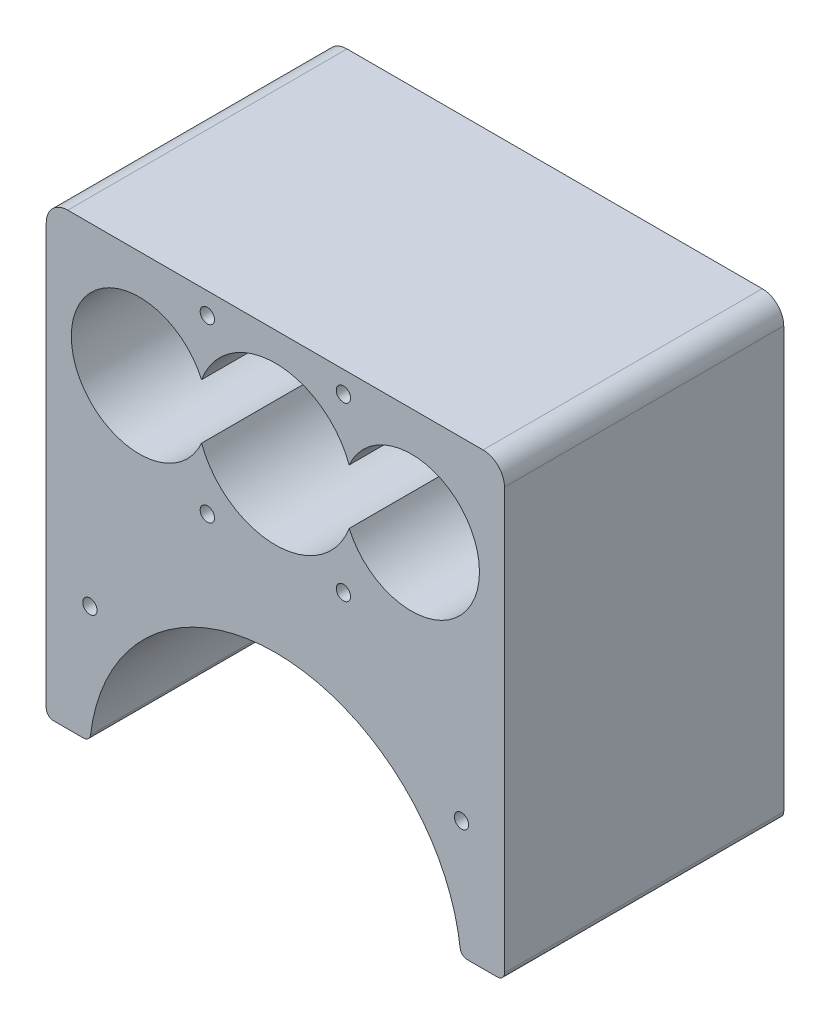
ISO-10303-21;
HEADER;
FILE_DESCRIPTION(('STEP AP214'),'2;1');
FILE_NAME('part.step','',(''),(''),'','','');
FILE_SCHEMA(('AUTOMOTIVE_DESIGN { 1 0 10303 214 1 1 1 1 }'));
ENDSEC;
DATA;
#1=APPLICATION_CONTEXT('core data for automotive mechanical design processes');
#2=APPLICATION_PROTOCOL_DEFINITION('international standard','automotive_design',2000,#1);
#3=PRODUCT_CONTEXT('',#1,'mechanical');
#4=PRODUCT('Part','Part','',(#3));
#5=PRODUCT_RELATED_PRODUCT_CATEGORY('part','',(#4));
#6=PRODUCT_DEFINITION_FORMATION('','',#4);
#7=PRODUCT_DEFINITION_CONTEXT('part definition',#1,'design');
#8=PRODUCT_DEFINITION('design','',#6,#7);
#9=PRODUCT_DEFINITION_SHAPE('','',#8);
#10=(LENGTH_UNIT() NAMED_UNIT(*) SI_UNIT(.MILLI.,.METRE.));
#11=(NAMED_UNIT(*) PLANE_ANGLE_UNIT() SI_UNIT($,.RADIAN.));
#12=(NAMED_UNIT(*) SI_UNIT($,.STERADIAN.) SOLID_ANGLE_UNIT());
#13=UNCERTAINTY_MEASURE_WITH_UNIT(LENGTH_MEASURE(1.E-05),#10,'distance_accuracy_value','');
#14=(GEOMETRIC_REPRESENTATION_CONTEXT(3) GLOBAL_UNCERTAINTY_ASSIGNED_CONTEXT((#13)) GLOBAL_UNIT_ASSIGNED_CONTEXT((#10,
#11,#12)) REPRESENTATION_CONTEXT('',''));
#15=CARTESIAN_POINT('',(0.,0.,0.));
#16=DIRECTION('',(0.,0.,1.));
#17=DIRECTION('',(1.,0.,0.));
#18=AXIS2_PLACEMENT_3D('',#15,#16,#17);
#19=CARTESIAN_POINT('',(-31.,-46.7536466451019,39.));
#20=DIRECTION('',(0.,0.,1.));
#21=DIRECTION('',(1.,0.,0.));
#22=AXIS2_PLACEMENT_3D('',#19,#20,#21);
#23=PLANE('',#22);
#24=CARTESIAN_POINT('',(-25.9027777777778,-31.358962600586,39.));
#25=DIRECTION('',(0.,0.,1.));
#26=DIRECTION('',(1.,0.,0.));
#27=AXIS2_PLACEMENT_3D('',#24,#25,#26);
#28=CIRCLE('',#27,1.);
#29=CARTESIAN_POINT('',(-24.9027777777778,-31.358962600586,39.));
#30=VERTEX_POINT('',#29);
#31=EDGE_CURVE('E557',#30,#30,#28,.T.);
#32=ORIENTED_EDGE('',*,*,#31,.F.);
#33=EDGE_LOOP('',(#32));
#34=FACE_BOUND('',#33,.T.);
#35=CARTESIAN_POINT('',(9.5,-12.,39.));
#36=DIRECTION('',(0.,0.,1.));
#37=DIRECTION('',(1.,0.,0.));
#38=AXIS2_PLACEMENT_3D('',#35,#36,#37);
#39=CIRCLE('',#38,1.);
#40=CARTESIAN_POINT('',(10.5,-12.,39.));
#41=VERTEX_POINT('',#40);
#42=EDGE_CURVE('E569',#41,#41,#39,.T.);
#43=ORIENTED_EDGE('',*,*,#42,.F.);
#44=EDGE_LOOP('',(#43));
#45=FACE_BOUND('',#44,.T.);
#46=CARTESIAN_POINT('',(-9.49999999999999,12.,39.));
#47=DIRECTION('',(0.,0.,1.));
#48=DIRECTION('',(1.,0.,0.));
#49=AXIS2_PLACEMENT_3D('',#46,#47,#48);
#50=CIRCLE('',#49,1.);
#51=CARTESIAN_POINT('',(-8.49999999999999,12.,39.));
#52=VERTEX_POINT('',#51);
#53=EDGE_CURVE('E175',#52,#52,#50,.T.);
#54=ORIENTED_EDGE('',*,*,#53,.F.);
#55=EDGE_LOOP('',(#54));
#56=FACE_BOUND('',#55,.T.);
#57=CARTESIAN_POINT('',(-31.,-46.7536466451019,39.));
#58=DIRECTION('',(0.,0.,1.));
#59=DIRECTION('',(1.,0.,0.));
#60=AXIS2_PLACEMENT_3D('',#57,#58,#59);
#61=CIRCLE('',#60,1.);
#62=CARTESIAN_POINT('',(-32.,-46.7536466451019,39.));
#63=VERTEX_POINT('',#62);
#64=CARTESIAN_POINT('',(-31.,-47.7536466451019,39.));
#65=VERTEX_POINT('',#64);
#66=EDGE_CURVE('E185',#63,#65,#61,.T.);
#67=ORIENTED_EDGE('',*,*,#66,.T.);
#68=DIRECTION('',(1.,0.,0.));
#69=VECTOR('',#68,1.);
#70=CARTESIAN_POINT('',(-31.,-47.7536466451019,39.));
#71=LINE('',#70,#69);
#72=CARTESIAN_POINT('',(-26.8041263594832,-47.7536466451019,39.));
#73=VERTEX_POINT('',#72);
#74=EDGE_CURVE('E188',#65,#73,#71,.T.);
#75=ORIENTED_EDGE('',*,*,#74,.T.);
#76=CARTESIAN_POINT('',(-26.8041263594832,-46.7536466451019,39.));
#77=DIRECTION('',(0.,0.,1.));
#78=DIRECTION('',(-1.,0.,0.));
#79=AXIS2_PLACEMENT_3D('',#76,#77,#78);
#80=CIRCLE('',#79,1.);
#81=CARTESIAN_POINT('',(-25.8113809387616,-46.8738819545426,39.));
#82=VERTEX_POINT('',#81);
#83=EDGE_CURVE('E191',#73,#82,#80,.T.);
#84=ORIENTED_EDGE('',*,*,#83,.T.);
#85=CARTESIAN_POINT('',(0.,-50.,39.));
#86=DIRECTION('',(0.,0.,-1.));
#87=DIRECTION('',(1.,0.,0.));
#88=AXIS2_PLACEMENT_3D('',#85,#86,#87);
#89=CIRCLE('',#88,26.);
#90=CARTESIAN_POINT('',(25.8113809387616,-46.8738819545426,39.));
#91=VERTEX_POINT('',#90);
#92=EDGE_CURVE('E193',#82,#91,#89,.T.);
#93=ORIENTED_EDGE('',*,*,#92,.T.);
#94=CARTESIAN_POINT('',(26.8041263594832,-46.7536466451019,39.));
#95=DIRECTION('',(0.,0.,1.));
#96=DIRECTION('',(-1.,0.,0.));
#97=AXIS2_PLACEMENT_3D('',#94,#95,#96);
#98=CIRCLE('',#97,1.);
#99=CARTESIAN_POINT('',(26.8041263594832,-47.7536466451019,39.));
#100=VERTEX_POINT('',#99);
#101=EDGE_CURVE('E195',#91,#100,#98,.T.);
#102=ORIENTED_EDGE('',*,*,#101,.T.);
#103=DIRECTION('',(1.,0.,0.));
#104=VECTOR('',#103,1.);
#105=CARTESIAN_POINT('',(31.,-47.7536466451019,39.));
#106=LINE('',#105,#104);
#107=CARTESIAN_POINT('',(31.,-47.7536466451019,39.));
#108=VERTEX_POINT('',#107);
#109=EDGE_CURVE('E197',#100,#108,#106,.T.);
#110=ORIENTED_EDGE('',*,*,#109,.T.);
#111=CARTESIAN_POINT('',(31.,-46.7536466451019,39.));
#112=DIRECTION('',(0.,0.,1.));
#113=DIRECTION('',(-1.,0.,0.));
#114=AXIS2_PLACEMENT_3D('',#111,#112,#113);
#115=CIRCLE('',#114,1.);
#116=CARTESIAN_POINT('',(32.,-46.7536466451019,39.));
#117=VERTEX_POINT('',#116);
#118=EDGE_CURVE('E199',#108,#117,#115,.T.);
#119=ORIENTED_EDGE('',*,*,#118,.T.);
#120=DIRECTION('',(0.,1.,0.));
#121=VECTOR('',#120,1.);
#122=CARTESIAN_POINT('',(32.,-17.,39.));
#123=LINE('',#122,#121);
#124=CARTESIAN_POINT('',(32.,12.,39.));
#125=VERTEX_POINT('',#124);
#126=EDGE_CURVE('E201',#117,#125,#123,.T.);
#127=ORIENTED_EDGE('',*,*,#126,.T.);
#128=CARTESIAN_POINT('',(29.,12.,39.));
#129=DIRECTION('',(0.,0.,1.));
#130=DIRECTION('',(-1.,0.,0.));
#131=AXIS2_PLACEMENT_3D('',#128,#129,#130);
#132=CIRCLE('',#131,3.);
#133=CARTESIAN_POINT('',(29.,15.,39.));
#134=VERTEX_POINT('',#133);
#135=EDGE_CURVE('E203',#125,#134,#132,.T.);
#136=ORIENTED_EDGE('',*,*,#135,.T.);
#137=DIRECTION('',(-1.,0.,0.));
#138=VECTOR('',#137,1.);
#139=CARTESIAN_POINT('',(-29.,15.,39.));
#140=LINE('',#139,#138);
#141=CARTESIAN_POINT('',(-29.,15.,39.));
#142=VERTEX_POINT('',#141);
#143=EDGE_CURVE('E205',#134,#142,#140,.T.);
#144=ORIENTED_EDGE('',*,*,#143,.T.);
#145=CARTESIAN_POINT('',(-29.,12.,39.));
#146=DIRECTION('',(0.,0.,1.));
#147=DIRECTION('',(-1.,0.,0.));
#148=AXIS2_PLACEMENT_3D('',#145,#146,#147);
#149=CIRCLE('',#148,3.);
#150=CARTESIAN_POINT('',(-32.,12.,39.));
#151=VERTEX_POINT('',#150);
#152=EDGE_CURVE('E207',#142,#151,#149,.T.);
#153=ORIENTED_EDGE('',*,*,#152,.T.);
#154=DIRECTION('',(0.,-1.,0.));
#155=VECTOR('',#154,1.);
#156=CARTESIAN_POINT('',(-32.,-17.,39.));
#157=LINE('',#156,#155);
#158=EDGE_CURVE('E209',#151,#63,#157,.T.);
#159=ORIENTED_EDGE('',*,*,#158,.T.);
#160=EDGE_LOOP('',(#67,#75,#84,#93,#102,#110,#119,#127,#136,#144,#153,#159));
#161=FACE_BOUND('',#160,.T.);
#162=CARTESIAN_POINT('',(-19.,0.,39.));
#163=DIRECTION('',(0.,0.,1.));
#164=DIRECTION('',(1.,0.,0.));
#165=AXIS2_PLACEMENT_3D('',#162,#163,#164);
#166=CIRCLE('',#165,9.5);
#167=CARTESIAN_POINT('',(-10.3092105263158,3.83668845804552,39.));
#168=VERTEX_POINT('',#167);
#169=CARTESIAN_POINT('',(-10.3092105263158,-3.83668845804552,39.));
#170=VERTEX_POINT('',#169);
#171=EDGE_CURVE('E154',#168,#170,#166,.T.);
#172=ORIENTED_EDGE('',*,*,#171,.F.);
#173=CARTESIAN_POINT('',(0.,0.,39.));
#174=DIRECTION('',(0.,0.,1.));
#175=DIRECTION('',(1.,0.,0.));
#176=AXIS2_PLACEMENT_3D('',#173,#174,#175);
#177=CIRCLE('',#176,11.);
#178=CARTESIAN_POINT('',(10.3092105263158,3.83668845804553,39.));
#179=VERTEX_POINT('',#178);
#180=EDGE_CURVE('E146',#179,#168,#177,.T.);
#181=ORIENTED_EDGE('',*,*,#180,.F.);
#182=CARTESIAN_POINT('',(19.,0.,39.));
#183=DIRECTION('',(0.,0.,1.));
#184=DIRECTION('',(1.,0.,0.));
#185=AXIS2_PLACEMENT_3D('',#182,#183,#184);
#186=CIRCLE('',#185,9.5);
#187=CARTESIAN_POINT('',(10.3092105263158,-3.83668845804552,39.));
#188=VERTEX_POINT('',#187);
#189=EDGE_CURVE('E169',#188,#179,#186,.T.);
#190=ORIENTED_EDGE('',*,*,#189,.F.);
#191=CARTESIAN_POINT('',(0.,0.,39.));
#192=DIRECTION('',(0.,0.,1.));
#193=DIRECTION('',(1.,0.,0.));
#194=AXIS2_PLACEMENT_3D('',#191,#192,#193);
#195=CIRCLE('',#194,11.);
#196=EDGE_CURVE('E167',#170,#188,#195,.T.);
#197=ORIENTED_EDGE('',*,*,#196,.F.);
#198=EDGE_LOOP('',(#172,#181,#190,#197));
#199=FACE_BOUND('',#198,.T.);
#200=CARTESIAN_POINT('',(9.5,12.,39.));
#201=DIRECTION('',(0.,0.,1.));
#202=DIRECTION('',(1.,0.,0.));
#203=AXIS2_PLACEMENT_3D('',#200,#201,#202);
#204=CIRCLE('',#203,1.);
#205=CARTESIAN_POINT('',(10.5,12.,39.));
#206=VERTEX_POINT('',#205);
#207=EDGE_CURVE('E575',#206,#206,#204,.T.);
#208=ORIENTED_EDGE('',*,*,#207,.F.);
#209=EDGE_LOOP('',(#208));
#210=FACE_BOUND('',#209,.T.);
#211=CARTESIAN_POINT('',(-9.49999999999999,-12.,39.));
#212=DIRECTION('',(0.,0.,1.));
#213=DIRECTION('',(1.,0.,0.));
#214=AXIS2_PLACEMENT_3D('',#211,#212,#213);
#215=CIRCLE('',#214,1.);
#216=CARTESIAN_POINT('',(-8.49999999999999,-12.,39.));
#217=VERTEX_POINT('',#216);
#218=EDGE_CURVE('E563',#217,#217,#215,.T.);
#219=ORIENTED_EDGE('',*,*,#218,.F.);
#220=EDGE_LOOP('',(#219));
#221=FACE_BOUND('',#220,.T.);
#222=CARTESIAN_POINT('',(26.,-31.358962600586,39.));
#223=DIRECTION('',(0.,0.,1.));
#224=DIRECTION('',(1.,0.,0.));
#225=AXIS2_PLACEMENT_3D('',#222,#223,#224);
#226=CIRCLE('',#225,1.);
#227=CARTESIAN_POINT('',(27.,-31.358962600586,39.));
#228=VERTEX_POINT('',#227);
#229=EDGE_CURVE('E548',#228,#228,#226,.T.);
#230=ORIENTED_EDGE('',*,*,#229,.F.);
#231=EDGE_LOOP('',(#230));
#232=FACE_BOUND('',#231,.T.);
#233=ADVANCED_FACE('F33',(#34,#45,#56,#161,#199,#210,#221,#232),#23,.T.);
#234=CARTESIAN_POINT('',(-31.,-46.7536466451019,0.));
#235=DIRECTION('',(0.,0.,1.));
#236=DIRECTION('',(1.,0.,0.));
#237=AXIS2_PLACEMENT_3D('',#234,#235,#236);
#238=PLANE('',#237);
#239=CARTESIAN_POINT('',(-31.,-46.7536466451019,0.));
#240=DIRECTION('',(0.,0.,1.));
#241=DIRECTION('',(1.,0.,0.));
#242=AXIS2_PLACEMENT_3D('',#239,#240,#241);
#243=CIRCLE('',#242,1.);
#244=CARTESIAN_POINT('',(-32.,-46.7536466451019,0.));
#245=VERTEX_POINT('',#244);
#246=CARTESIAN_POINT('',(-31.,-47.7536466451019,0.));
#247=VERTEX_POINT('',#246);
#248=EDGE_CURVE('E162',#245,#247,#243,.T.);
#249=ORIENTED_EDGE('',*,*,#248,.F.);
#250=DIRECTION('',(0.,-1.,0.));
#251=VECTOR('',#250,1.);
#252=CARTESIAN_POINT('',(-32.,-17.,0.));
#253=LINE('',#252,#251);
#254=CARTESIAN_POINT('',(-32.,12.,0.));
#255=VERTEX_POINT('',#254);
#256=EDGE_CURVE('E189',#255,#245,#253,.T.);
#257=ORIENTED_EDGE('',*,*,#256,.F.);
#258=CARTESIAN_POINT('',(-29.,12.,0.));
#259=DIRECTION('',(0.,0.,1.));
#260=DIRECTION('',(-1.,0.,0.));
#261=AXIS2_PLACEMENT_3D('',#258,#259,#260);
#262=CIRCLE('',#261,3.);
#263=CARTESIAN_POINT('',(-29.,15.,0.));
#264=VERTEX_POINT('',#263);
#265=EDGE_CURVE('E233',#264,#255,#262,.T.);
#266=ORIENTED_EDGE('',*,*,#265,.F.);
#267=DIRECTION('',(-1.,0.,0.));
#268=VECTOR('',#267,1.);
#269=CARTESIAN_POINT('',(-29.,15.,0.));
#270=LINE('',#269,#268);
#271=CARTESIAN_POINT('',(29.,15.,0.));
#272=VERTEX_POINT('',#271);
#273=EDGE_CURVE('E231',#272,#264,#270,.T.);
#274=ORIENTED_EDGE('',*,*,#273,.F.);
#275=CARTESIAN_POINT('',(29.,12.,0.));
#276=DIRECTION('',(0.,0.,1.));
#277=DIRECTION('',(-1.,0.,0.));
#278=AXIS2_PLACEMENT_3D('',#275,#276,#277);
#279=CIRCLE('',#278,3.);
#280=CARTESIAN_POINT('',(32.,12.,0.));
#281=VERTEX_POINT('',#280);
#282=EDGE_CURVE('E229',#281,#272,#279,.T.);
#283=ORIENTED_EDGE('',*,*,#282,.F.);
#284=DIRECTION('',(0.,1.,0.));
#285=VECTOR('',#284,1.);
#286=CARTESIAN_POINT('',(32.,-17.,0.));
#287=LINE('',#286,#285);
#288=CARTESIAN_POINT('',(32.,-46.7536466451019,0.));
#289=VERTEX_POINT('',#288);
#290=EDGE_CURVE('E227',#289,#281,#287,.T.);
#291=ORIENTED_EDGE('',*,*,#290,.F.);
#292=CARTESIAN_POINT('',(31.,-46.7536466451019,0.));
#293=DIRECTION('',(0.,0.,1.));
#294=DIRECTION('',(-1.,0.,0.));
#295=AXIS2_PLACEMENT_3D('',#292,#293,#294);
#296=CIRCLE('',#295,1.);
#297=CARTESIAN_POINT('',(31.,-47.7536466451019,0.));
#298=VERTEX_POINT('',#297);
#299=EDGE_CURVE('E224',#298,#289,#296,.T.);
#300=ORIENTED_EDGE('',*,*,#299,.F.);
#301=DIRECTION('',(1.,0.,0.));
#302=VECTOR('',#301,1.);
#303=CARTESIAN_POINT('',(31.,-47.7536466451019,0.));
#304=LINE('',#303,#302);
#305=CARTESIAN_POINT('',(26.8041263594832,-47.7536466451019,0.));
#306=VERTEX_POINT('',#305);
#307=EDGE_CURVE('E222',#306,#298,#304,.T.);
#308=ORIENTED_EDGE('',*,*,#307,.F.);
#309=CARTESIAN_POINT('',(26.8041263594832,-46.7536466451019,0.));
#310=DIRECTION('',(0.,0.,1.));
#311=DIRECTION('',(-1.,0.,0.));
#312=AXIS2_PLACEMENT_3D('',#309,#310,#311);
#313=CIRCLE('',#312,1.);
#314=CARTESIAN_POINT('',(25.8113809387616,-46.8738819545426,0.));
#315=VERTEX_POINT('',#314);
#316=EDGE_CURVE('E220',#315,#306,#313,.T.);
#317=ORIENTED_EDGE('',*,*,#316,.F.);
#318=CARTESIAN_POINT('',(0.,-50.,0.));
#319=DIRECTION('',(0.,0.,-1.));
#320=DIRECTION('',(1.,0.,0.));
#321=AXIS2_PLACEMENT_3D('',#318,#319,#320);
#322=CIRCLE('',#321,26.);
#323=CARTESIAN_POINT('',(-25.8113809387616,-46.8738819545426,0.));
#324=VERTEX_POINT('',#323);
#325=EDGE_CURVE('E218',#324,#315,#322,.T.);
#326=ORIENTED_EDGE('',*,*,#325,.F.);
#327=CARTESIAN_POINT('',(-26.8041263594832,-46.7536466451019,0.));
#328=DIRECTION('',(0.,0.,1.));
#329=DIRECTION('',(-1.,0.,0.));
#330=AXIS2_PLACEMENT_3D('',#327,#328,#329);
#331=CIRCLE('',#330,1.);
#332=CARTESIAN_POINT('',(-26.8041263594832,-47.7536466451019,0.));
#333=VERTEX_POINT('',#332);
#334=EDGE_CURVE('E216',#333,#324,#331,.T.);
#335=ORIENTED_EDGE('',*,*,#334,.F.);
#336=DIRECTION('',(1.,0.,0.));
#337=VECTOR('',#336,1.);
#338=CARTESIAN_POINT('',(-31.,-47.7536466451019,0.));
#339=LINE('',#338,#337);
#340=EDGE_CURVE('E214',#247,#333,#339,.T.);
#341=ORIENTED_EDGE('',*,*,#340,.F.);
#342=EDGE_LOOP('',(#249,#257,#266,#274,#283,#291,#300,#308,#317,#326,#335,#341));
#343=FACE_BOUND('',#342,.T.);
#344=CARTESIAN_POINT('',(0.,0.,0.));
#345=DIRECTION('',(0.,0.,1.));
#346=DIRECTION('',(1.,0.,0.));
#347=AXIS2_PLACEMENT_3D('',#344,#345,#346);
#348=CIRCLE('',#347,11.);
#349=CARTESIAN_POINT('',(10.3092105263158,3.83668845804553,0.));
#350=VERTEX_POINT('',#349);
#351=CARTESIAN_POINT('',(-10.3092105263158,3.83668845804552,0.));
#352=VERTEX_POINT('',#351);
#353=EDGE_CURVE('E56',#350,#352,#348,.T.);
#354=ORIENTED_EDGE('',*,*,#353,.T.);
#355=CARTESIAN_POINT('',(-19.,0.,0.));
#356=DIRECTION('',(0.,0.,1.));
#357=DIRECTION('',(1.,0.,0.));
#358=AXIS2_PLACEMENT_3D('',#355,#356,#357);
#359=CIRCLE('',#358,9.5);
#360=CARTESIAN_POINT('',(-10.3092105263158,-3.83668845804552,0.));
#361=VERTEX_POINT('',#360);
#362=EDGE_CURVE('E161',#352,#361,#359,.T.);
#363=ORIENTED_EDGE('',*,*,#362,.T.);
#364=CARTESIAN_POINT('',(0.,0.,0.));
#365=DIRECTION('',(0.,0.,1.));
#366=DIRECTION('',(1.,0.,0.));
#367=AXIS2_PLACEMENT_3D('',#364,#365,#366);
#368=CIRCLE('',#367,11.);
#369=CARTESIAN_POINT('',(10.3092105263158,-3.83668845804552,0.));
#370=VERTEX_POINT('',#369);
#371=EDGE_CURVE('E177',#361,#370,#368,.T.);
#372=ORIENTED_EDGE('',*,*,#371,.T.);
#373=CARTESIAN_POINT('',(19.,0.,0.));
#374=DIRECTION('',(0.,0.,1.));
#375=DIRECTION('',(1.,0.,0.));
#376=AXIS2_PLACEMENT_3D('',#373,#374,#375);
#377=CIRCLE('',#376,9.5);
#378=EDGE_CURVE('E155',#370,#350,#377,.T.);
#379=ORIENTED_EDGE('',*,*,#378,.T.);
#380=EDGE_LOOP('',(#354,#363,#372,#379));
#381=FACE_BOUND('',#380,.T.);
#382=CARTESIAN_POINT('',(-9.49999999999999,12.,0.));
#383=DIRECTION('',(0.,0.,1.));
#384=DIRECTION('',(1.,0.,0.));
#385=AXIS2_PLACEMENT_3D('',#382,#383,#384);
#386=CIRCLE('',#385,1.);
#387=CARTESIAN_POINT('',(-8.49999999999999,12.,0.));
#388=VERTEX_POINT('',#387);
#389=EDGE_CURVE('E578',#388,#388,#386,.T.);
#390=ORIENTED_EDGE('',*,*,#389,.T.);
#391=EDGE_LOOP('',(#390));
#392=FACE_BOUND('',#391,.T.);
#393=CARTESIAN_POINT('',(9.5,12.,0.));
#394=DIRECTION('',(0.,0.,1.));
#395=DIRECTION('',(1.,0.,0.));
#396=AXIS2_PLACEMENT_3D('',#393,#394,#395);
#397=CIRCLE('',#396,1.);
#398=CARTESIAN_POINT('',(10.5,12.,0.));
#399=VERTEX_POINT('',#398);
#400=EDGE_CURVE('E572',#399,#399,#397,.T.);
#401=ORIENTED_EDGE('',*,*,#400,.T.);
#402=EDGE_LOOP('',(#401));
#403=FACE_BOUND('',#402,.T.);
#404=CARTESIAN_POINT('',(9.5,-12.,0.));
#405=DIRECTION('',(0.,0.,1.));
#406=DIRECTION('',(1.,0.,0.));
#407=AXIS2_PLACEMENT_3D('',#404,#405,#406);
#408=CIRCLE('',#407,1.);
#409=CARTESIAN_POINT('',(10.5,-12.,0.));
#410=VERTEX_POINT('',#409);
#411=EDGE_CURVE('E566',#410,#410,#408,.T.);
#412=ORIENTED_EDGE('',*,*,#411,.T.);
#413=EDGE_LOOP('',(#412));
#414=FACE_BOUND('',#413,.T.);
#415=CARTESIAN_POINT('',(-9.49999999999999,-12.,0.));
#416=DIRECTION('',(0.,0.,1.));
#417=DIRECTION('',(1.,0.,0.));
#418=AXIS2_PLACEMENT_3D('',#415,#416,#417);
#419=CIRCLE('',#418,1.);
#420=CARTESIAN_POINT('',(-8.49999999999999,-12.,0.));
#421=VERTEX_POINT('',#420);
#422=EDGE_CURVE('E560',#421,#421,#419,.T.);
#423=ORIENTED_EDGE('',*,*,#422,.T.);
#424=EDGE_LOOP('',(#423));
#425=FACE_BOUND('',#424,.T.);
#426=CARTESIAN_POINT('',(-25.9027777777778,-31.358962600586,0.));
#427=DIRECTION('',(0.,0.,1.));
#428=DIRECTION('',(1.,0.,0.));
#429=AXIS2_PLACEMENT_3D('',#426,#427,#428);
#430=CIRCLE('',#429,1.);
#431=CARTESIAN_POINT('',(-24.9027777777778,-31.358962600586,0.));
#432=VERTEX_POINT('',#431);
#433=EDGE_CURVE('E554',#432,#432,#430,.T.);
#434=ORIENTED_EDGE('',*,*,#433,.T.);
#435=EDGE_LOOP('',(#434));
#436=FACE_BOUND('',#435,.T.);
#437=CARTESIAN_POINT('',(26.,-31.358962600586,0.));
#438=DIRECTION('',(0.,0.,1.));
#439=DIRECTION('',(1.,0.,0.));
#440=AXIS2_PLACEMENT_3D('',#437,#438,#439);
#441=CIRCLE('',#440,1.);
#442=CARTESIAN_POINT('',(27.,-31.358962600586,0.));
#443=VERTEX_POINT('',#442);
#444=EDGE_CURVE('E551',#443,#443,#441,.T.);
#445=ORIENTED_EDGE('',*,*,#444,.T.);
#446=EDGE_LOOP('',(#445));
#447=FACE_BOUND('',#446,.T.);
#448=ADVANCED_FACE('F276',(#343,#381,#392,#403,#414,#425,#436,#447),#238,.F.);
#449=CARTESIAN_POINT('',(-31.,-46.7536466451019,39.));
#450=DIRECTION('',(0.,0.,-1.));
#451=DIRECTION('',(-1.,0.,0.));
#452=AXIS2_PLACEMENT_3D('',#449,#450,#451);
#453=CYLINDRICAL_SURFACE('',#452,1.);
#454=ORIENTED_EDGE('',*,*,#248,.T.);
#455=DIRECTION('',(0.,0.,-1.));
#456=VECTOR('',#455,1.);
#457=CARTESIAN_POINT('',(-31.,-47.7536466451019,39.));
#458=LINE('',#457,#456);
#459=EDGE_CURVE('E11',#65,#247,#458,.T.);
#460=ORIENTED_EDGE('',*,*,#459,.F.);
#461=ORIENTED_EDGE('',*,*,#66,.F.);
#462=DIRECTION('',(0.,0.,-1.));
#463=VECTOR('',#462,1.);
#464=CARTESIAN_POINT('',(-32.,-46.7536466451019,39.));
#465=LINE('',#464,#463);
#466=EDGE_CURVE('E211',#63,#245,#465,.T.);
#467=ORIENTED_EDGE('',*,*,#466,.T.);
#468=EDGE_LOOP('',(#454,#460,#461,#467));
#469=FACE_BOUND('',#468,.T.);
#470=ADVANCED_FACE('F35',(#469),#453,.T.);
#471=CARTESIAN_POINT('',(-31.,-47.7536466451019,39.));
#472=DIRECTION('',(0.,1.,0.));
#473=DIRECTION('',(0.,0.,1.));
#474=AXIS2_PLACEMENT_3D('',#471,#472,#473);
#475=PLANE('',#474);
#476=ORIENTED_EDGE('',*,*,#340,.T.);
#477=DIRECTION('',(0.,0.,-1.));
#478=VECTOR('',#477,1.);
#479=CARTESIAN_POINT('',(-26.8041263594832,-47.7536466451019,39.));
#480=LINE('',#479,#478);
#481=EDGE_CURVE('E41',#73,#333,#480,.T.);
#482=ORIENTED_EDGE('',*,*,#481,.F.);
#483=ORIENTED_EDGE('',*,*,#74,.F.);
#484=ORIENTED_EDGE('',*,*,#459,.T.);
#485=EDGE_LOOP('',(#476,#482,#483,#484));
#486=FACE_BOUND('',#485,.T.);
#487=ADVANCED_FACE('F293',(#486),#475,.F.);
#488=CARTESIAN_POINT('',(-26.8041263594832,-46.7536466451019,39.));
#489=DIRECTION('',(0.,0.,-1.));
#490=DIRECTION('',(-1.,0.,0.));
#491=AXIS2_PLACEMENT_3D('',#488,#489,#490);
#492=CYLINDRICAL_SURFACE('',#491,1.);
#493=ORIENTED_EDGE('',*,*,#334,.T.);
#494=DIRECTION('',(0.,0.,-1.));
#495=VECTOR('',#494,1.);
#496=CARTESIAN_POINT('',(-25.8113809387616,-46.8738819545426,39.));
#497=LINE('',#496,#495);
#498=EDGE_CURVE('E263',#82,#324,#497,.T.);
#499=ORIENTED_EDGE('',*,*,#498,.F.);
#500=ORIENTED_EDGE('',*,*,#83,.F.);
#501=ORIENTED_EDGE('',*,*,#481,.T.);
#502=EDGE_LOOP('',(#493,#499,#500,#501));
#503=FACE_BOUND('',#502,.T.);
#504=ADVANCED_FACE('F270',(#503),#492,.T.);
#505=CARTESIAN_POINT('',(0.,-50.,39.));
#506=DIRECTION('',(0.,0.,-1.));
#507=DIRECTION('',(-1.,0.,0.));
#508=AXIS2_PLACEMENT_3D('',#505,#506,#507);
#509=CYLINDRICAL_SURFACE('',#508,26.);
#510=ORIENTED_EDGE('',*,*,#325,.T.);
#511=DIRECTION('',(0.,0.,-1.));
#512=VECTOR('',#511,1.);
#513=CARTESIAN_POINT('',(25.8113809387616,-46.8738819545426,39.));
#514=LINE('',#513,#512);
#515=EDGE_CURVE('E260',#91,#315,#514,.T.);
#516=ORIENTED_EDGE('',*,*,#515,.F.);
#517=ORIENTED_EDGE('',*,*,#92,.F.);
#518=ORIENTED_EDGE('',*,*,#498,.T.);
#519=EDGE_LOOP('',(#510,#516,#517,#518));
#520=FACE_BOUND('',#519,.T.);
#521=ADVANCED_FACE('F282',(#520),#509,.F.);
#522=CARTESIAN_POINT('',(26.8041263594832,-46.7536466451019,39.));
#523=DIRECTION('',(0.,0.,-1.));
#524=DIRECTION('',(-1.,0.,0.));
#525=AXIS2_PLACEMENT_3D('',#522,#523,#524);
#526=CYLINDRICAL_SURFACE('',#525,1.);
#527=ORIENTED_EDGE('',*,*,#316,.T.);
#528=DIRECTION('',(0.,0.,-1.));
#529=VECTOR('',#528,1.);
#530=CARTESIAN_POINT('',(26.8041263594832,-47.7536466451019,39.));
#531=LINE('',#530,#529);
#532=EDGE_CURVE('E257',#100,#306,#531,.T.);
#533=ORIENTED_EDGE('',*,*,#532,.F.);
#534=ORIENTED_EDGE('',*,*,#101,.F.);
#535=ORIENTED_EDGE('',*,*,#515,.T.);
#536=EDGE_LOOP('',(#527,#533,#534,#535));
#537=FACE_BOUND('',#536,.T.);
#538=ADVANCED_FACE('F286',(#537),#526,.T.);
#539=CARTESIAN_POINT('',(31.,-47.7536466451019,39.));
#540=DIRECTION('',(0.,1.,0.));
#541=DIRECTION('',(0.,0.,1.));
#542=AXIS2_PLACEMENT_3D('',#539,#540,#541);
#543=PLANE('',#542);
#544=ORIENTED_EDGE('',*,*,#307,.T.);
#545=DIRECTION('',(0.,0.,-1.));
#546=VECTOR('',#545,1.);
#547=CARTESIAN_POINT('',(31.,-47.7536466451019,39.));
#548=LINE('',#547,#546);
#549=EDGE_CURVE('E254',#108,#298,#548,.T.);
#550=ORIENTED_EDGE('',*,*,#549,.F.);
#551=ORIENTED_EDGE('',*,*,#109,.F.);
#552=ORIENTED_EDGE('',*,*,#532,.T.);
#553=EDGE_LOOP('',(#544,#550,#551,#552));
#554=FACE_BOUND('',#553,.T.);
#555=ADVANCED_FACE('F324',(#554),#543,.F.);
#556=CARTESIAN_POINT('',(31.,-46.7536466451019,39.));
#557=DIRECTION('',(0.,0.,-1.));
#558=DIRECTION('',(-1.,0.,0.));
#559=AXIS2_PLACEMENT_3D('',#556,#557,#558);
#560=CYLINDRICAL_SURFACE('',#559,1.);
#561=ORIENTED_EDGE('',*,*,#299,.T.);
#562=DIRECTION('',(0.,0.,-1.));
#563=VECTOR('',#562,1.);
#564=CARTESIAN_POINT('',(32.,-46.7536466451019,39.));
#565=LINE('',#564,#563);
#566=EDGE_CURVE('E251',#117,#289,#565,.T.);
#567=ORIENTED_EDGE('',*,*,#566,.F.);
#568=ORIENTED_EDGE('',*,*,#118,.F.);
#569=ORIENTED_EDGE('',*,*,#549,.T.);
#570=EDGE_LOOP('',(#561,#567,#568,#569));
#571=FACE_BOUND('',#570,.T.);
#572=ADVANCED_FACE('F322',(#571),#560,.T.);
#573=CARTESIAN_POINT('',(32.,-17.,39.));
#574=DIRECTION('',(-1.,0.,0.));
#575=DIRECTION('',(0.,0.,1.));
#576=AXIS2_PLACEMENT_3D('',#573,#574,#575);
#577=PLANE('',#576);
#578=ORIENTED_EDGE('',*,*,#290,.T.);
#579=DIRECTION('',(0.,0.,-1.));
#580=VECTOR('',#579,1.);
#581=CARTESIAN_POINT('',(32.,12.,39.));
#582=LINE('',#581,#580);
#583=EDGE_CURVE('E248',#125,#281,#582,.T.);
#584=ORIENTED_EDGE('',*,*,#583,.F.);
#585=ORIENTED_EDGE('',*,*,#126,.F.);
#586=ORIENTED_EDGE('',*,*,#566,.T.);
#587=EDGE_LOOP('',(#578,#584,#585,#586));
#588=FACE_BOUND('',#587,.T.);
#589=ADVANCED_FACE('F318',(#588),#577,.F.);
#590=CARTESIAN_POINT('',(29.,12.,39.));
#591=DIRECTION('',(0.,0.,-1.));
#592=DIRECTION('',(-1.,0.,0.));
#593=AXIS2_PLACEMENT_3D('',#590,#591,#592);
#594=CYLINDRICAL_SURFACE('',#593,3.);
#595=ORIENTED_EDGE('',*,*,#282,.T.);
#596=DIRECTION('',(0.,0.,-1.));
#597=VECTOR('',#596,1.);
#598=CARTESIAN_POINT('',(29.,15.,39.));
#599=LINE('',#598,#597);
#600=EDGE_CURVE('E245',#134,#272,#599,.T.);
#601=ORIENTED_EDGE('',*,*,#600,.F.);
#602=ORIENTED_EDGE('',*,*,#135,.F.);
#603=ORIENTED_EDGE('',*,*,#583,.T.);
#604=EDGE_LOOP('',(#595,#601,#602,#603));
#605=FACE_BOUND('',#604,.T.);
#606=ADVANCED_FACE('F314',(#605),#594,.T.);
#607=CARTESIAN_POINT('',(-29.,15.,39.));
#608=DIRECTION('',(0.,-1.,0.));
#609=DIRECTION('',(0.,0.,-1.));
#610=AXIS2_PLACEMENT_3D('',#607,#608,#609);
#611=PLANE('',#610);
#612=ORIENTED_EDGE('',*,*,#273,.T.);
#613=DIRECTION('',(0.,0.,-1.));
#614=VECTOR('',#613,1.);
#615=CARTESIAN_POINT('',(-29.,15.,39.));
#616=LINE('',#615,#614);
#617=EDGE_CURVE('E242',#142,#264,#616,.T.);
#618=ORIENTED_EDGE('',*,*,#617,.F.);
#619=ORIENTED_EDGE('',*,*,#143,.F.);
#620=ORIENTED_EDGE('',*,*,#600,.T.);
#621=EDGE_LOOP('',(#612,#618,#619,#620));
#622=FACE_BOUND('',#621,.T.);
#623=ADVANCED_FACE('F310',(#622),#611,.F.);
#624=CARTESIAN_POINT('',(-29.,12.,39.));
#625=DIRECTION('',(0.,0.,-1.));
#626=DIRECTION('',(-1.,0.,0.));
#627=AXIS2_PLACEMENT_3D('',#624,#625,#626);
#628=CYLINDRICAL_SURFACE('',#627,3.);
#629=ORIENTED_EDGE('',*,*,#265,.T.);
#630=DIRECTION('',(0.,0.,-1.));
#631=VECTOR('',#630,1.);
#632=CARTESIAN_POINT('',(-32.,12.,39.));
#633=LINE('',#632,#631);
#634=EDGE_CURVE('E239',#151,#255,#633,.T.);
#635=ORIENTED_EDGE('',*,*,#634,.F.);
#636=ORIENTED_EDGE('',*,*,#152,.F.);
#637=ORIENTED_EDGE('',*,*,#617,.T.);
#638=EDGE_LOOP('',(#629,#635,#636,#637));
#639=FACE_BOUND('',#638,.T.);
#640=ADVANCED_FACE('F301',(#639),#628,.T.);
#641=CARTESIAN_POINT('',(-32.,-17.,39.));
#642=DIRECTION('',(1.,0.,0.));
#643=DIRECTION('',(0.,0.,-1.));
#644=AXIS2_PLACEMENT_3D('',#641,#642,#643);
#645=PLANE('',#644);
#646=ORIENTED_EDGE('',*,*,#256,.T.);
#647=ORIENTED_EDGE('',*,*,#466,.F.);
#648=ORIENTED_EDGE('',*,*,#158,.F.);
#649=ORIENTED_EDGE('',*,*,#634,.T.);
#650=EDGE_LOOP('',(#646,#647,#648,#649));
#651=FACE_BOUND('',#650,.T.);
#652=ADVANCED_FACE('F305',(#651),#645,.F.);
#653=CARTESIAN_POINT('',(0.,0.,39.));
#654=DIRECTION('',(0.,0.,-1.));
#655=DIRECTION('',(-1.,0.,0.));
#656=AXIS2_PLACEMENT_3D('',#653,#654,#655);
#657=CYLINDRICAL_SURFACE('',#656,11.);
#658=ORIENTED_EDGE('',*,*,#353,.F.);
#659=DIRECTION('',(0.,0.,-1.));
#660=VECTOR('',#659,1.);
#661=CARTESIAN_POINT('',(10.3092105263158,3.83668845804553,39.));
#662=LINE('',#661,#660);
#663=EDGE_CURVE('E150',#179,#350,#662,.T.);
#664=ORIENTED_EDGE('',*,*,#663,.F.);
#665=ORIENTED_EDGE('',*,*,#180,.T.);
#666=DIRECTION('',(0.,0.,-1.));
#667=VECTOR('',#666,1.);
#668=CARTESIAN_POINT('',(-10.3092105263158,3.83668845804552,39.));
#669=LINE('',#668,#667);
#670=EDGE_CURVE('E149',#168,#352,#669,.T.);
#671=ORIENTED_EDGE('',*,*,#670,.T.);
#672=EDGE_LOOP('',(#658,#664,#665,#671));
#673=FACE_BOUND('',#672,.T.);
#674=ADVANCED_FACE('F148',(#673),#657,.F.);
#675=CARTESIAN_POINT('',(-19.,0.,39.));
#676=DIRECTION('',(0.,0.,-1.));
#677=DIRECTION('',(-1.,0.,0.));
#678=AXIS2_PLACEMENT_3D('',#675,#676,#677);
#679=CYLINDRICAL_SURFACE('',#678,9.5);
#680=ORIENTED_EDGE('',*,*,#362,.F.);
#681=ORIENTED_EDGE('',*,*,#670,.F.);
#682=ORIENTED_EDGE('',*,*,#171,.T.);
#683=DIRECTION('',(0.,0.,-1.));
#684=VECTOR('',#683,1.);
#685=CARTESIAN_POINT('',(-10.3092105263158,-3.83668845804552,39.));
#686=LINE('',#685,#684);
#687=EDGE_CURVE('E163',#170,#361,#686,.T.);
#688=ORIENTED_EDGE('',*,*,#687,.T.);
#689=EDGE_LOOP('',(#680,#681,#682,#688));
#690=FACE_BOUND('',#689,.T.);
#691=ADVANCED_FACE('F158',(#690),#679,.F.);
#692=CARTESIAN_POINT('',(0.,0.,39.));
#693=DIRECTION('',(0.,0.,-1.));
#694=DIRECTION('',(-1.,0.,0.));
#695=AXIS2_PLACEMENT_3D('',#692,#693,#694);
#696=CYLINDRICAL_SURFACE('',#695,11.);
#697=ORIENTED_EDGE('',*,*,#371,.F.);
#698=ORIENTED_EDGE('',*,*,#687,.F.);
#699=ORIENTED_EDGE('',*,*,#196,.T.);
#700=DIRECTION('',(0.,0.,-1.));
#701=VECTOR('',#700,1.);
#702=CARTESIAN_POINT('',(10.3092105263158,-3.83668845804552,39.));
#703=LINE('',#702,#701);
#704=EDGE_CURVE('E48',#188,#370,#703,.T.);
#705=ORIENTED_EDGE('',*,*,#704,.T.);
#706=EDGE_LOOP('',(#697,#698,#699,#705));
#707=FACE_BOUND('',#706,.T.);
#708=ADVANCED_FACE('F385',(#707),#696,.F.);
#709=CARTESIAN_POINT('',(19.,0.,39.));
#710=DIRECTION('',(0.,0.,-1.));
#711=DIRECTION('',(-1.,0.,0.));
#712=AXIS2_PLACEMENT_3D('',#709,#710,#711);
#713=CYLINDRICAL_SURFACE('',#712,9.5);
#714=ORIENTED_EDGE('',*,*,#378,.F.);
#715=ORIENTED_EDGE('',*,*,#704,.F.);
#716=ORIENTED_EDGE('',*,*,#189,.T.);
#717=ORIENTED_EDGE('',*,*,#663,.T.);
#718=EDGE_LOOP('',(#714,#715,#716,#717));
#719=FACE_BOUND('',#718,.T.);
#720=ADVANCED_FACE('F391',(#719),#713,.F.);
#721=CARTESIAN_POINT('',(-9.49999999999999,12.,39.));
#722=DIRECTION('',(0.,0.,-1.));
#723=DIRECTION('',(-1.,0.,0.));
#724=AXIS2_PLACEMENT_3D('',#721,#722,#723);
#725=CYLINDRICAL_SURFACE('',#724,1.);
#726=ORIENTED_EDGE('',*,*,#53,.T.);
#727=EDGE_LOOP('',(#726));
#728=FACE_BOUND('',#727,.T.);
#729=ORIENTED_EDGE('',*,*,#389,.F.);
#730=EDGE_LOOP('',(#729));
#731=FACE_BOUND('',#730,.T.);
#732=ADVANCED_FACE('F399',(#728,#731),#725,.F.);
#733=CARTESIAN_POINT('',(9.5,12.,39.));
#734=DIRECTION('',(0.,0.,-1.));
#735=DIRECTION('',(-1.,0.,0.));
#736=AXIS2_PLACEMENT_3D('',#733,#734,#735);
#737=CYLINDRICAL_SURFACE('',#736,1.);
#738=ORIENTED_EDGE('',*,*,#207,.T.);
#739=EDGE_LOOP('',(#738));
#740=FACE_BOUND('',#739,.T.);
#741=ORIENTED_EDGE('',*,*,#400,.F.);
#742=EDGE_LOOP('',(#741));
#743=FACE_BOUND('',#742,.T.);
#744=ADVANCED_FACE('F406',(#740,#743),#737,.F.);
#745=CARTESIAN_POINT('',(9.5,-12.,39.));
#746=DIRECTION('',(0.,0.,-1.));
#747=DIRECTION('',(-1.,0.,0.));
#748=AXIS2_PLACEMENT_3D('',#745,#746,#747);
#749=CYLINDRICAL_SURFACE('',#748,1.);
#750=ORIENTED_EDGE('',*,*,#42,.T.);
#751=EDGE_LOOP('',(#750));
#752=FACE_BOUND('',#751,.T.);
#753=ORIENTED_EDGE('',*,*,#411,.F.);
#754=EDGE_LOOP('',(#753));
#755=FACE_BOUND('',#754,.T.);
#756=ADVANCED_FACE('F414',(#752,#755),#749,.F.);
#757=CARTESIAN_POINT('',(-9.49999999999999,-12.,39.));
#758=DIRECTION('',(0.,0.,-1.));
#759=DIRECTION('',(-1.,0.,0.));
#760=AXIS2_PLACEMENT_3D('',#757,#758,#759);
#761=CYLINDRICAL_SURFACE('',#760,1.);
#762=ORIENTED_EDGE('',*,*,#218,.T.);
#763=EDGE_LOOP('',(#762));
#764=FACE_BOUND('',#763,.T.);
#765=ORIENTED_EDGE('',*,*,#422,.F.);
#766=EDGE_LOOP('',(#765));
#767=FACE_BOUND('',#766,.T.);
#768=ADVANCED_FACE('F422',(#764,#767),#761,.F.);
#769=CARTESIAN_POINT('',(-25.9027777777778,-31.358962600586,39.));
#770=DIRECTION('',(0.,0.,-1.));
#771=DIRECTION('',(-1.,0.,0.));
#772=AXIS2_PLACEMENT_3D('',#769,#770,#771);
#773=CYLINDRICAL_SURFACE('',#772,1.);
#774=ORIENTED_EDGE('',*,*,#31,.T.);
#775=EDGE_LOOP('',(#774));
#776=FACE_BOUND('',#775,.T.);
#777=ORIENTED_EDGE('',*,*,#433,.F.);
#778=EDGE_LOOP('',(#777));
#779=FACE_BOUND('',#778,.T.);
#780=ADVANCED_FACE('F430',(#776,#779),#773,.F.);
#781=CARTESIAN_POINT('',(26.,-31.358962600586,39.));
#782=DIRECTION('',(0.,0.,-1.));
#783=DIRECTION('',(-1.,0.,0.));
#784=AXIS2_PLACEMENT_3D('',#781,#782,#783);
#785=CYLINDRICAL_SURFACE('',#784,1.);
#786=ORIENTED_EDGE('',*,*,#229,.T.);
#787=EDGE_LOOP('',(#786));
#788=FACE_BOUND('',#787,.T.);
#789=ORIENTED_EDGE('',*,*,#444,.F.);
#790=EDGE_LOOP('',(#789));
#791=FACE_BOUND('',#790,.T.);
#792=ADVANCED_FACE('F438',(#788,#791),#785,.F.);
#793=CLOSED_SHELL('',(#233,#448,#470,#487,#504,#521,#538,#555,#572,#589,#606,#623,#640,#652,
#674,#691,#708,#720,#732,#744,#756,#768,#780,#792));
#794=MANIFOLD_SOLID_BREP('B2',#793);
#795=ADVANCED_BREP_SHAPE_REPRESENTATION('',(#18,#794),#14);
#796=SHAPE_DEFINITION_REPRESENTATION(#9,#795);
ENDSEC;
END-ISO-10303-21;
